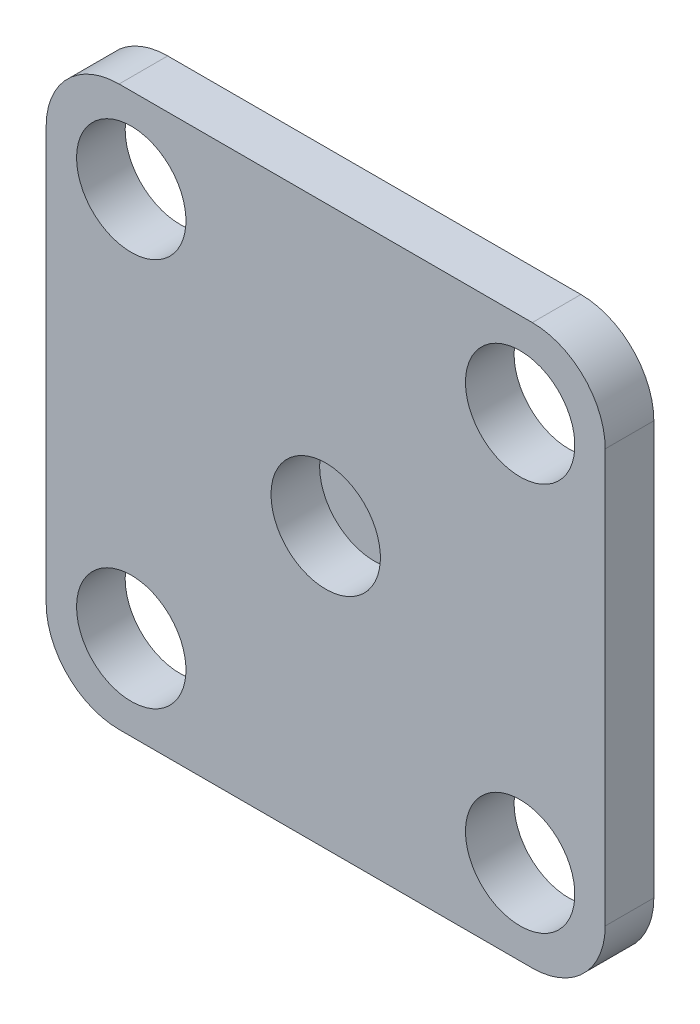
ISO-10303-21;
HEADER;
FILE_DESCRIPTION(('STEP AP214'),'2;1');
FILE_NAME('part.step','',(''),(''),'','','');
FILE_SCHEMA(('AUTOMOTIVE_DESIGN { 1 0 10303 214 1 1 1 1 }'));
ENDSEC;
DATA;
#1=APPLICATION_CONTEXT('core data for automotive mechanical design processes');
#2=APPLICATION_PROTOCOL_DEFINITION('international standard','automotive_design',2000,#1);
#3=PRODUCT_CONTEXT('',#1,'mechanical');
#4=PRODUCT('Part','Part','',(#3));
#5=PRODUCT_RELATED_PRODUCT_CATEGORY('part','',(#4));
#6=PRODUCT_DEFINITION_FORMATION('','',#4);
#7=PRODUCT_DEFINITION_CONTEXT('part definition',#1,'design');
#8=PRODUCT_DEFINITION('design','',#6,#7);
#9=PRODUCT_DEFINITION_SHAPE('','',#8);
#10=(LENGTH_UNIT() NAMED_UNIT(*) SI_UNIT(.MILLI.,.METRE.));
#11=(NAMED_UNIT(*) PLANE_ANGLE_UNIT() SI_UNIT($,.RADIAN.));
#12=(NAMED_UNIT(*) SI_UNIT($,.STERADIAN.) SOLID_ANGLE_UNIT());
#13=UNCERTAINTY_MEASURE_WITH_UNIT(LENGTH_MEASURE(1.E-05),#10,'distance_accuracy_value','');
#14=(GEOMETRIC_REPRESENTATION_CONTEXT(3) GLOBAL_UNCERTAINTY_ASSIGNED_CONTEXT((#13)) GLOBAL_UNIT_ASSIGNED_CONTEXT((#10,
#11,#12)) REPRESENTATION_CONTEXT('',''));
#15=CARTESIAN_POINT('',(0.,0.,0.));
#16=DIRECTION('',(0.,0.,1.));
#17=DIRECTION('',(1.,0.,0.));
#18=AXIS2_PLACEMENT_3D('',#15,#16,#17);
#19=CARTESIAN_POINT('',(0.,0.,2.));
#20=DIRECTION('',(1.,0.,0.));
#21=DIRECTION('',(0.,0.,-1.));
#22=AXIS2_PLACEMENT_3D('',#19,#20,#21);
#23=PLANE('',#22);
#24=DIRECTION('',(0.,-1.,0.));
#25=VECTOR('',#24,1.);
#26=CARTESIAN_POINT('',(0.,0.,2.));
#27=LINE('',#26,#25);
#28=CARTESIAN_POINT('',(0.,20.,2.));
#29=VERTEX_POINT('',#28);
#30=CARTESIAN_POINT('',(0.,3.,2.));
#31=VERTEX_POINT('',#30);
#32=EDGE_CURVE('E165',#29,#31,#27,.T.);
#33=ORIENTED_EDGE('',*,*,#32,.F.);
#34=DIRECTION('',(0.,0.,-1.));
#35=VECTOR('',#34,1.);
#36=CARTESIAN_POINT('',(0.,20.,2.));
#37=LINE('',#36,#35);
#38=CARTESIAN_POINT('',(0.,20.,0.));
#39=VERTEX_POINT('',#38);
#40=EDGE_CURVE('E184',#29,#39,#37,.T.);
#41=ORIENTED_EDGE('',*,*,#40,.T.);
#42=DIRECTION('',(0.,-1.,0.));
#43=VECTOR('',#42,1.);
#44=CARTESIAN_POINT('',(0.,0.,0.));
#45=LINE('',#44,#43);
#46=CARTESIAN_POINT('',(0.,3.,0.));
#47=VERTEX_POINT('',#46);
#48=EDGE_CURVE('E156',#39,#47,#45,.T.);
#49=ORIENTED_EDGE('',*,*,#48,.T.);
#50=DIRECTION('',(0.,0.,-1.));
#51=VECTOR('',#50,1.);
#52=CARTESIAN_POINT('',(0.,3.,2.));
#53=LINE('',#52,#51);
#54=EDGE_CURVE('E175',#47,#31,#53,.F.);
#55=ORIENTED_EDGE('',*,*,#54,.T.);
#56=EDGE_LOOP('',(#33,#41,#49,#55));
#57=FACE_BOUND('',#56,.T.);
#58=ADVANCED_FACE('F41',(#57),#23,.F.);
#59=CARTESIAN_POINT('',(0.,0.,2.));
#60=DIRECTION('',(0.,1.,0.));
#61=DIRECTION('',(0.,0.,1.));
#62=AXIS2_PLACEMENT_3D('',#59,#60,#61);
#63=PLANE('',#62);
#64=DIRECTION('',(1.,0.,0.));
#65=VECTOR('',#64,1.);
#66=CARTESIAN_POINT('',(0.,0.,2.));
#67=LINE('',#66,#65);
#68=CARTESIAN_POINT('',(3.,0.,2.));
#69=VERTEX_POINT('',#68);
#70=CARTESIAN_POINT('',(20.,0.,2.));
#71=VERTEX_POINT('',#70);
#72=EDGE_CURVE('E168',#69,#71,#67,.T.);
#73=ORIENTED_EDGE('',*,*,#72,.F.);
#74=DIRECTION('',(0.,0.,-1.));
#75=VECTOR('',#74,1.);
#76=CARTESIAN_POINT('',(3.,0.,2.));
#77=LINE('',#76,#75);
#78=CARTESIAN_POINT('',(3.,0.,0.));
#79=VERTEX_POINT('',#78);
#80=EDGE_CURVE('E209',#69,#79,#77,.T.);
#81=ORIENTED_EDGE('',*,*,#80,.T.);
#82=DIRECTION('',(1.,0.,0.));
#83=VECTOR('',#82,1.);
#84=CARTESIAN_POINT('',(0.,0.,0.));
#85=LINE('',#84,#83);
#86=CARTESIAN_POINT('',(20.,0.,0.));
#87=VERTEX_POINT('',#86);
#88=EDGE_CURVE('E159',#79,#87,#85,.T.);
#89=ORIENTED_EDGE('',*,*,#88,.T.);
#90=DIRECTION('',(0.,0.,-1.));
#91=VECTOR('',#90,1.);
#92=CARTESIAN_POINT('',(20.,0.,2.));
#93=LINE('',#92,#91);
#94=EDGE_CURVE('E207',#87,#71,#93,.F.);
#95=ORIENTED_EDGE('',*,*,#94,.T.);
#96=EDGE_LOOP('',(#73,#81,#89,#95));
#97=FACE_BOUND('',#96,.T.);
#98=ADVANCED_FACE('F215',(#97),#63,.F.);
#99=CARTESIAN_POINT('',(23.,0.,2.));
#100=DIRECTION('',(-1.,0.,0.));
#101=DIRECTION('',(0.,0.,1.));
#102=AXIS2_PLACEMENT_3D('',#99,#100,#101);
#103=PLANE('',#102);
#104=DIRECTION('',(0.,1.,0.));
#105=VECTOR('',#104,1.);
#106=CARTESIAN_POINT('',(23.,0.,2.));
#107=LINE('',#106,#105);
#108=CARTESIAN_POINT('',(23.,3.,2.));
#109=VERTEX_POINT('',#108);
#110=CARTESIAN_POINT('',(23.,20.,2.));
#111=VERTEX_POINT('',#110);
#112=EDGE_CURVE('E171',#109,#111,#107,.T.);
#113=ORIENTED_EDGE('',*,*,#112,.F.);
#114=DIRECTION('',(0.,0.,-1.));
#115=VECTOR('',#114,1.);
#116=CARTESIAN_POINT('',(23.,3.,2.));
#117=LINE('',#116,#115);
#118=CARTESIAN_POINT('',(23.,3.,0.));
#119=VERTEX_POINT('',#118);
#120=EDGE_CURVE('E11',#109,#119,#117,.T.);
#121=ORIENTED_EDGE('',*,*,#120,.T.);
#122=DIRECTION('',(0.,1.,0.));
#123=VECTOR('',#122,1.);
#124=CARTESIAN_POINT('',(23.,0.,0.));
#125=LINE('',#124,#123);
#126=CARTESIAN_POINT('',(23.,20.,0.));
#127=VERTEX_POINT('',#126);
#128=EDGE_CURVE('E179',#119,#127,#125,.T.);
#129=ORIENTED_EDGE('',*,*,#128,.T.);
#130=DIRECTION('',(0.,0.,-1.));
#131=VECTOR('',#130,1.);
#132=CARTESIAN_POINT('',(23.,20.,2.));
#133=LINE('',#132,#131);
#134=EDGE_CURVE('E49',#127,#111,#133,.F.);
#135=ORIENTED_EDGE('',*,*,#134,.T.);
#136=EDGE_LOOP('',(#113,#121,#129,#135));
#137=FACE_BOUND('',#136,.T.);
#138=ADVANCED_FACE('F226',(#137),#103,.F.);
#139=CARTESIAN_POINT('',(0.,23.,2.));
#140=DIRECTION('',(0.,-1.,0.));
#141=DIRECTION('',(0.,0.,-1.));
#142=AXIS2_PLACEMENT_3D('',#139,#140,#141);
#143=PLANE('',#142);
#144=DIRECTION('',(-1.,0.,0.));
#145=VECTOR('',#144,1.);
#146=CARTESIAN_POINT('',(0.,23.,0.));
#147=LINE('',#146,#145);
#148=CARTESIAN_POINT('',(20.,23.,0.));
#149=VERTEX_POINT('',#148);
#150=CARTESIAN_POINT('',(3.,23.,0.));
#151=VERTEX_POINT('',#150);
#152=EDGE_CURVE('E169',#149,#151,#147,.T.);
#153=ORIENTED_EDGE('',*,*,#152,.T.);
#154=DIRECTION('',(0.,0.,-1.));
#155=VECTOR('',#154,1.);
#156=CARTESIAN_POINT('',(3.,23.,2.));
#157=LINE('',#156,#155);
#158=CARTESIAN_POINT('',(3.,23.,2.));
#159=VERTEX_POINT('',#158);
#160=EDGE_CURVE('E198',#151,#159,#157,.F.);
#161=ORIENTED_EDGE('',*,*,#160,.T.);
#162=DIRECTION('',(-1.,0.,0.));
#163=VECTOR('',#162,1.);
#164=CARTESIAN_POINT('',(0.,23.,2.));
#165=LINE('',#164,#163);
#166=CARTESIAN_POINT('',(20.,23.,2.));
#167=VERTEX_POINT('',#166);
#168=EDGE_CURVE('E173',#167,#159,#165,.T.);
#169=ORIENTED_EDGE('',*,*,#168,.F.);
#170=DIRECTION('',(0.,0.,-1.));
#171=VECTOR('',#170,1.);
#172=CARTESIAN_POINT('',(20.,23.,2.));
#173=LINE('',#172,#171);
#174=EDGE_CURVE('E195',#167,#149,#173,.T.);
#175=ORIENTED_EDGE('',*,*,#174,.T.);
#176=EDGE_LOOP('',(#153,#161,#169,#175));
#177=FACE_BOUND('',#176,.T.);
#178=ADVANCED_FACE('F234',(#177),#143,.F.);
#179=CARTESIAN_POINT('',(0.,0.,2.));
#180=DIRECTION('',(0.,0.,-1.));
#181=DIRECTION('',(-1.,0.,0.));
#182=AXIS2_PLACEMENT_3D('',#179,#180,#181);
#183=PLANE('',#182);
#184=CARTESIAN_POINT('',(11.5,11.5,2.));
#185=DIRECTION('',(0.,0.,-1.));
#186=DIRECTION('',(-1.,0.,0.));
#187=AXIS2_PLACEMENT_3D('',#184,#185,#186);
#188=CIRCLE('',#187,2.25);
#189=CARTESIAN_POINT('',(9.25,11.5,2.));
#190=VERTEX_POINT('',#189);
#191=EDGE_CURVE('E310',#190,#190,#188,.T.);
#192=ORIENTED_EDGE('',*,*,#191,.T.);
#193=EDGE_LOOP('',(#192));
#194=FACE_BOUND('',#193,.T.);
#195=CARTESIAN_POINT('',(3.5,19.5,2.));
#196=DIRECTION('',(0.,0.,-1.));
#197=DIRECTION('',(-1.,0.,0.));
#198=AXIS2_PLACEMENT_3D('',#195,#196,#197);
#199=CIRCLE('',#198,2.25);
#200=CARTESIAN_POINT('',(1.25,19.5,2.));
#201=VERTEX_POINT('',#200);
#202=EDGE_CURVE('E320',#201,#201,#199,.T.);
#203=ORIENTED_EDGE('',*,*,#202,.T.);
#204=EDGE_LOOP('',(#203));
#205=FACE_BOUND('',#204,.T.);
#206=CARTESIAN_POINT('',(19.5,3.5,2.));
#207=DIRECTION('',(0.,0.,-1.));
#208=DIRECTION('',(-1.,0.,0.));
#209=AXIS2_PLACEMENT_3D('',#206,#207,#208);
#210=CIRCLE('',#209,2.25);
#211=CARTESIAN_POINT('',(17.25,3.5,2.));
#212=VERTEX_POINT('',#211);
#213=EDGE_CURVE('E326',#212,#212,#210,.T.);
#214=ORIENTED_EDGE('',*,*,#213,.T.);
#215=EDGE_LOOP('',(#214));
#216=FACE_BOUND('',#215,.T.);
#217=CARTESIAN_POINT('',(19.5,19.5,2.));
#218=DIRECTION('',(0.,0.,-1.));
#219=DIRECTION('',(-1.,0.,0.));
#220=AXIS2_PLACEMENT_3D('',#217,#218,#219);
#221=CIRCLE('',#220,2.25);
#222=CARTESIAN_POINT('',(17.25,19.5,2.));
#223=VERTEX_POINT('',#222);
#224=EDGE_CURVE('E332',#223,#223,#221,.T.);
#225=ORIENTED_EDGE('',*,*,#224,.T.);
#226=EDGE_LOOP('',(#225));
#227=FACE_BOUND('',#226,.T.);
#228=CARTESIAN_POINT('',(3.5,3.5,2.));
#229=DIRECTION('',(0.,0.,-1.));
#230=DIRECTION('',(-1.,0.,0.));
#231=AXIS2_PLACEMENT_3D('',#228,#229,#230);
#232=CIRCLE('',#231,2.25);
#233=CARTESIAN_POINT('',(1.25,3.5,2.));
#234=VERTEX_POINT('',#233);
#235=EDGE_CURVE('E338',#234,#234,#232,.T.);
#236=ORIENTED_EDGE('',*,*,#235,.T.);
#237=EDGE_LOOP('',(#236));
#238=FACE_BOUND('',#237,.T.);
#239=ORIENTED_EDGE('',*,*,#168,.T.);
#240=CARTESIAN_POINT('',(3.,20.,2.));
#241=DIRECTION('',(0.,0.,-1.));
#242=DIRECTION('',(-1.,0.,0.));
#243=AXIS2_PLACEMENT_3D('',#240,#241,#242);
#244=CIRCLE('',#243,3.);
#245=EDGE_CURVE('E205',#159,#29,#244,.F.);
#246=ORIENTED_EDGE('',*,*,#245,.T.);
#247=ORIENTED_EDGE('',*,*,#32,.T.);
#248=CARTESIAN_POINT('',(3.,3.,2.));
#249=DIRECTION('',(0.,0.,-1.));
#250=DIRECTION('',(-1.,0.,0.));
#251=AXIS2_PLACEMENT_3D('',#248,#249,#250);
#252=CIRCLE('',#251,3.);
#253=EDGE_CURVE('E203',#31,#69,#252,.F.);
#254=ORIENTED_EDGE('',*,*,#253,.T.);
#255=ORIENTED_EDGE('',*,*,#72,.T.);
#256=CARTESIAN_POINT('',(20.,3.,2.));
#257=DIRECTION('',(0.,0.,-1.));
#258=DIRECTION('',(-1.,0.,0.));
#259=AXIS2_PLACEMENT_3D('',#256,#257,#258);
#260=CIRCLE('',#259,3.);
#261=EDGE_CURVE('E62',#71,#109,#260,.F.);
#262=ORIENTED_EDGE('',*,*,#261,.T.);
#263=ORIENTED_EDGE('',*,*,#112,.T.);
#264=CARTESIAN_POINT('',(20.,20.,2.));
#265=DIRECTION('',(0.,0.,-1.));
#266=DIRECTION('',(-1.,0.,0.));
#267=AXIS2_PLACEMENT_3D('',#264,#265,#266);
#268=CIRCLE('',#267,3.);
#269=EDGE_CURVE('E200',#111,#167,#268,.F.);
#270=ORIENTED_EDGE('',*,*,#269,.T.);
#271=EDGE_LOOP('',(#239,#246,#247,#254,#255,#262,#263,#270));
#272=FACE_BOUND('',#271,.T.);
#273=ADVANCED_FACE('F228',(#194,#205,#216,#227,#238,#272),#183,.F.);
#274=CARTESIAN_POINT('',(0.,0.,0.));
#275=DIRECTION('',(0.,0.,-1.));
#276=DIRECTION('',(-1.,0.,0.));
#277=AXIS2_PLACEMENT_3D('',#274,#275,#276);
#278=PLANE('',#277);
#279=CARTESIAN_POINT('',(3.5,19.5,0.));
#280=DIRECTION('',(0.,0.,-1.));
#281=DIRECTION('',(-1.,0.,0.));
#282=AXIS2_PLACEMENT_3D('',#279,#280,#281);
#283=CIRCLE('',#282,2.24999999999999);
#284=CARTESIAN_POINT('',(1.25000000000001,19.5,0.));
#285=VERTEX_POINT('',#284);
#286=EDGE_CURVE('E315',#285,#285,#283,.T.);
#287=ORIENTED_EDGE('',*,*,#286,.F.);
#288=EDGE_LOOP('',(#287));
#289=FACE_BOUND('',#288,.T.);
#290=CARTESIAN_POINT('',(19.5,3.5,0.));
#291=DIRECTION('',(0.,0.,-1.));
#292=DIRECTION('',(-1.,0.,0.));
#293=AXIS2_PLACEMENT_3D('',#290,#291,#292);
#294=CIRCLE('',#293,2.24999999999999);
#295=CARTESIAN_POINT('',(17.25,3.5,0.));
#296=VERTEX_POINT('',#295);
#297=EDGE_CURVE('E323',#296,#296,#294,.T.);
#298=ORIENTED_EDGE('',*,*,#297,.F.);
#299=EDGE_LOOP('',(#298));
#300=FACE_BOUND('',#299,.T.);
#301=CARTESIAN_POINT('',(19.5,19.5,0.));
#302=DIRECTION('',(0.,0.,-1.));
#303=DIRECTION('',(-1.,0.,0.));
#304=AXIS2_PLACEMENT_3D('',#301,#302,#303);
#305=CIRCLE('',#304,2.24999999999999);
#306=CARTESIAN_POINT('',(17.25,19.5,0.));
#307=VERTEX_POINT('',#306);
#308=EDGE_CURVE('E329',#307,#307,#305,.T.);
#309=ORIENTED_EDGE('',*,*,#308,.F.);
#310=EDGE_LOOP('',(#309));
#311=FACE_BOUND('',#310,.T.);
#312=CARTESIAN_POINT('',(3.5,3.5,0.));
#313=DIRECTION('',(0.,0.,-1.));
#314=DIRECTION('',(-1.,0.,0.));
#315=AXIS2_PLACEMENT_3D('',#312,#313,#314);
#316=CIRCLE('',#315,2.24999999999999);
#317=CARTESIAN_POINT('',(1.25000000000001,3.5,0.));
#318=VERTEX_POINT('',#317);
#319=EDGE_CURVE('E335',#318,#318,#316,.T.);
#320=ORIENTED_EDGE('',*,*,#319,.F.);
#321=EDGE_LOOP('',(#320));
#322=FACE_BOUND('',#321,.T.);
#323=DIRECTION('',(-1.,0.,0.));
#324=VECTOR('',#323,1.);
#325=CARTESIAN_POINT('',(15.,8.,0.));
#326=LINE('',#325,#324);
#327=CARTESIAN_POINT('',(15.,8.,0.));
#328=VERTEX_POINT('',#327);
#329=CARTESIAN_POINT('',(8.,8.,0.));
#330=VERTEX_POINT('',#329);
#331=EDGE_CURVE('E155',#328,#330,#326,.T.);
#332=ORIENTED_EDGE('',*,*,#331,.F.);
#333=DIRECTION('',(0.,-1.,0.));
#334=VECTOR('',#333,1.);
#335=CARTESIAN_POINT('',(15.,15.,0.));
#336=LINE('',#335,#334);
#337=CARTESIAN_POINT('',(15.,15.,0.));
#338=VERTEX_POINT('',#337);
#339=EDGE_CURVE('E152',#338,#328,#336,.T.);
#340=ORIENTED_EDGE('',*,*,#339,.F.);
#341=DIRECTION('',(1.,0.,0.));
#342=VECTOR('',#341,1.);
#343=CARTESIAN_POINT('',(8.,15.,0.));
#344=LINE('',#343,#342);
#345=CARTESIAN_POINT('',(8.,15.,0.));
#346=VERTEX_POINT('',#345);
#347=EDGE_CURVE('E347',#346,#338,#344,.T.);
#348=ORIENTED_EDGE('',*,*,#347,.F.);
#349=DIRECTION('',(0.,1.,0.));
#350=VECTOR('',#349,1.);
#351=CARTESIAN_POINT('',(8.,8.,0.));
#352=LINE('',#351,#350);
#353=EDGE_CURVE('E345',#330,#346,#352,.T.);
#354=ORIENTED_EDGE('',*,*,#353,.F.);
#355=EDGE_LOOP('',(#332,#340,#348,#354));
#356=FACE_BOUND('',#355,.T.);
#357=ORIENTED_EDGE('',*,*,#48,.F.);
#358=CARTESIAN_POINT('',(3.,20.,0.));
#359=DIRECTION('',(0.,0.,-1.));
#360=DIRECTION('',(-1.,0.,0.));
#361=AXIS2_PLACEMENT_3D('',#358,#359,#360);
#362=CIRCLE('',#361,3.);
#363=EDGE_CURVE('E193',#39,#151,#362,.T.);
#364=ORIENTED_EDGE('',*,*,#363,.T.);
#365=ORIENTED_EDGE('',*,*,#152,.F.);
#366=CARTESIAN_POINT('',(20.,20.,0.));
#367=DIRECTION('',(0.,0.,-1.));
#368=DIRECTION('',(-1.,0.,0.));
#369=AXIS2_PLACEMENT_3D('',#366,#367,#368);
#370=CIRCLE('',#369,3.);
#371=EDGE_CURVE('E187',#149,#127,#370,.T.);
#372=ORIENTED_EDGE('',*,*,#371,.T.);
#373=ORIENTED_EDGE('',*,*,#128,.F.);
#374=CARTESIAN_POINT('',(20.,3.,0.));
#375=DIRECTION('',(0.,0.,-1.));
#376=DIRECTION('',(-1.,0.,0.));
#377=AXIS2_PLACEMENT_3D('',#374,#375,#376);
#378=CIRCLE('',#377,3.);
#379=EDGE_CURVE('E189',#119,#87,#378,.T.);
#380=ORIENTED_EDGE('',*,*,#379,.T.);
#381=ORIENTED_EDGE('',*,*,#88,.F.);
#382=CARTESIAN_POINT('',(3.,3.,0.));
#383=DIRECTION('',(0.,0.,-1.));
#384=DIRECTION('',(-1.,0.,0.));
#385=AXIS2_PLACEMENT_3D('',#382,#383,#384);
#386=CIRCLE('',#385,3.);
#387=EDGE_CURVE('E191',#79,#47,#386,.T.);
#388=ORIENTED_EDGE('',*,*,#387,.T.);
#389=EDGE_LOOP('',(#357,#364,#365,#372,#373,#380,#381,#388));
#390=FACE_BOUND('',#389,.T.);
#391=ADVANCED_FACE('F221',(#289,#300,#311,#322,#356,#390),#278,.T.);
#392=CARTESIAN_POINT('',(15.,8.,-1.5));
#393=DIRECTION('',(0.,1.,0.));
#394=DIRECTION('',(0.,0.,1.));
#395=AXIS2_PLACEMENT_3D('',#392,#393,#394);
#396=PLANE('',#395);
#397=ORIENTED_EDGE('',*,*,#331,.T.);
#398=DIRECTION('',(0.,0.,1.));
#399=VECTOR('',#398,1.);
#400=CARTESIAN_POINT('',(8.,8.,-1.5));
#401=LINE('',#400,#399);
#402=CARTESIAN_POINT('',(8.,8.,-1.5));
#403=VERTEX_POINT('',#402);
#404=EDGE_CURVE('E136',#403,#330,#401,.T.);
#405=ORIENTED_EDGE('',*,*,#404,.F.);
#406=DIRECTION('',(-1.,0.,0.));
#407=VECTOR('',#406,1.);
#408=CARTESIAN_POINT('',(15.,8.,-1.5));
#409=LINE('',#408,#407);
#410=CARTESIAN_POINT('',(15.,8.,-1.5));
#411=VERTEX_POINT('',#410);
#412=EDGE_CURVE('E143',#411,#403,#409,.T.);
#413=ORIENTED_EDGE('',*,*,#412,.F.);
#414=DIRECTION('',(0.,0.,1.));
#415=VECTOR('',#414,1.);
#416=CARTESIAN_POINT('',(15.,8.,-1.5));
#417=LINE('',#416,#415);
#418=EDGE_CURVE('E343',#411,#328,#417,.T.);
#419=ORIENTED_EDGE('',*,*,#418,.T.);
#420=EDGE_LOOP('',(#397,#405,#413,#419));
#421=FACE_BOUND('',#420,.T.);
#422=ADVANCED_FACE('F154',(#421),#396,.F.);
#423=CARTESIAN_POINT('',(8.,8.,-1.5));
#424=DIRECTION('',(1.,0.,0.));
#425=DIRECTION('',(0.,0.,-1.));
#426=AXIS2_PLACEMENT_3D('',#423,#424,#425);
#427=PLANE('',#426);
#428=ORIENTED_EDGE('',*,*,#353,.T.);
#429=DIRECTION('',(0.,0.,1.));
#430=VECTOR('',#429,1.);
#431=CARTESIAN_POINT('',(8.,15.,-1.5));
#432=LINE('',#431,#430);
#433=CARTESIAN_POINT('',(8.,15.,-1.5));
#434=VERTEX_POINT('',#433);
#435=EDGE_CURVE('E139',#434,#346,#432,.T.);
#436=ORIENTED_EDGE('',*,*,#435,.F.);
#437=DIRECTION('',(0.,1.,0.));
#438=VECTOR('',#437,1.);
#439=CARTESIAN_POINT('',(8.,8.,-1.5));
#440=LINE('',#439,#438);
#441=EDGE_CURVE('E131',#403,#434,#440,.T.);
#442=ORIENTED_EDGE('',*,*,#441,.F.);
#443=ORIENTED_EDGE('',*,*,#404,.T.);
#444=EDGE_LOOP('',(#428,#436,#442,#443));
#445=FACE_BOUND('',#444,.T.);
#446=ADVANCED_FACE('F134',(#445),#427,.F.);
#447=CARTESIAN_POINT('',(8.,15.,-1.5));
#448=DIRECTION('',(0.,-1.,0.));
#449=DIRECTION('',(0.,0.,-1.));
#450=AXIS2_PLACEMENT_3D('',#447,#448,#449);
#451=PLANE('',#450);
#452=ORIENTED_EDGE('',*,*,#347,.T.);
#453=DIRECTION('',(0.,0.,1.));
#454=VECTOR('',#453,1.);
#455=CARTESIAN_POINT('',(15.,15.,-1.5));
#456=LINE('',#455,#454);
#457=CARTESIAN_POINT('',(15.,15.,-1.5));
#458=VERTEX_POINT('',#457);
#459=EDGE_CURVE('E161',#458,#338,#456,.T.);
#460=ORIENTED_EDGE('',*,*,#459,.F.);
#461=DIRECTION('',(1.,0.,0.));
#462=VECTOR('',#461,1.);
#463=CARTESIAN_POINT('',(8.,15.,-1.5));
#464=LINE('',#463,#462);
#465=EDGE_CURVE('E142',#434,#458,#464,.T.);
#466=ORIENTED_EDGE('',*,*,#465,.F.);
#467=ORIENTED_EDGE('',*,*,#435,.T.);
#468=EDGE_LOOP('',(#452,#460,#466,#467));
#469=FACE_BOUND('',#468,.T.);
#470=ADVANCED_FACE('F273',(#469),#451,.F.);
#471=CARTESIAN_POINT('',(15.,15.,-1.5));
#472=DIRECTION('',(-1.,0.,0.));
#473=DIRECTION('',(0.,0.,1.));
#474=AXIS2_PLACEMENT_3D('',#471,#472,#473);
#475=PLANE('',#474);
#476=ORIENTED_EDGE('',*,*,#339,.T.);
#477=ORIENTED_EDGE('',*,*,#418,.F.);
#478=DIRECTION('',(0.,-1.,0.));
#479=VECTOR('',#478,1.);
#480=CARTESIAN_POINT('',(15.,15.,-1.5));
#481=LINE('',#480,#479);
#482=EDGE_CURVE('E148',#458,#411,#481,.T.);
#483=ORIENTED_EDGE('',*,*,#482,.F.);
#484=ORIENTED_EDGE('',*,*,#459,.T.);
#485=EDGE_LOOP('',(#476,#477,#483,#484));
#486=FACE_BOUND('',#485,.T.);
#487=ADVANCED_FACE('F276',(#486),#475,.F.);
#488=CARTESIAN_POINT('',(0.,0.,-1.5));
#489=DIRECTION('',(0.,0.,-1.));
#490=DIRECTION('',(-1.,0.,0.));
#491=AXIS2_PLACEMENT_3D('',#488,#489,#490);
#492=PLANE('',#491);
#493=ORIENTED_EDGE('',*,*,#412,.T.);
#494=ORIENTED_EDGE('',*,*,#441,.T.);
#495=ORIENTED_EDGE('',*,*,#465,.T.);
#496=ORIENTED_EDGE('',*,*,#482,.T.);
#497=EDGE_LOOP('',(#493,#494,#495,#496));
#498=FACE_BOUND('',#497,.T.);
#499=ADVANCED_FACE('F146',(#498),#492,.T.);
#500=CARTESIAN_POINT('',(3.,20.,2.));
#501=DIRECTION('',(0.,0.,-1.));
#502=DIRECTION('',(-1.,0.,0.));
#503=AXIS2_PLACEMENT_3D('',#500,#501,#502);
#504=CYLINDRICAL_SURFACE('',#503,3.);
#505=ORIENTED_EDGE('',*,*,#245,.F.);
#506=ORIENTED_EDGE('',*,*,#160,.F.);
#507=ORIENTED_EDGE('',*,*,#363,.F.);
#508=ORIENTED_EDGE('',*,*,#40,.F.);
#509=EDGE_LOOP('',(#505,#506,#507,#508));
#510=FACE_BOUND('',#509,.T.);
#511=ADVANCED_FACE('F239',(#510),#504,.T.);
#512=CARTESIAN_POINT('',(3.,3.,2.));
#513=DIRECTION('',(0.,0.,-1.));
#514=DIRECTION('',(-1.,0.,0.));
#515=AXIS2_PLACEMENT_3D('',#512,#513,#514);
#516=CYLINDRICAL_SURFACE('',#515,3.);
#517=ORIENTED_EDGE('',*,*,#253,.F.);
#518=ORIENTED_EDGE('',*,*,#54,.F.);
#519=ORIENTED_EDGE('',*,*,#387,.F.);
#520=ORIENTED_EDGE('',*,*,#80,.F.);
#521=EDGE_LOOP('',(#517,#518,#519,#520));
#522=FACE_BOUND('',#521,.T.);
#523=ADVANCED_FACE('F243',(#522),#516,.T.);
#524=CARTESIAN_POINT('',(20.,3.,2.));
#525=DIRECTION('',(0.,0.,-1.));
#526=DIRECTION('',(-1.,0.,0.));
#527=AXIS2_PLACEMENT_3D('',#524,#525,#526);
#528=CYLINDRICAL_SURFACE('',#527,3.);
#529=ORIENTED_EDGE('',*,*,#261,.F.);
#530=ORIENTED_EDGE('',*,*,#94,.F.);
#531=ORIENTED_EDGE('',*,*,#379,.F.);
#532=ORIENTED_EDGE('',*,*,#120,.F.);
#533=EDGE_LOOP('',(#529,#530,#531,#532));
#534=FACE_BOUND('',#533,.T.);
#535=ADVANCED_FACE('F225',(#534),#528,.T.);
#536=CARTESIAN_POINT('',(20.,20.,2.));
#537=DIRECTION('',(0.,0.,-1.));
#538=DIRECTION('',(-1.,0.,0.));
#539=AXIS2_PLACEMENT_3D('',#536,#537,#538);
#540=CYLINDRICAL_SURFACE('',#539,3.);
#541=ORIENTED_EDGE('',*,*,#269,.F.);
#542=ORIENTED_EDGE('',*,*,#134,.F.);
#543=ORIENTED_EDGE('',*,*,#371,.F.);
#544=ORIENTED_EDGE('',*,*,#174,.F.);
#545=EDGE_LOOP('',(#541,#542,#543,#544));
#546=FACE_BOUND('',#545,.T.);
#547=ADVANCED_FACE('F43',(#546),#540,.T.);
#548=CARTESIAN_POINT('',(3.5,3.5,0.));
#549=DIRECTION('',(0.,0.,-1.));
#550=DIRECTION('',(-1.,0.,0.));
#551=AXIS2_PLACEMENT_3D('',#548,#549,#550);
#552=CYLINDRICAL_SURFACE('',#551,2.24999999999999);
#553=ORIENTED_EDGE('',*,*,#235,.F.);
#554=EDGE_LOOP('',(#553));
#555=FACE_BOUND('',#554,.T.);
#556=ORIENTED_EDGE('',*,*,#319,.T.);
#557=EDGE_LOOP('',(#556));
#558=FACE_BOUND('',#557,.T.);
#559=ADVANCED_FACE('F282',(#555,#558),#552,.F.);
#560=CARTESIAN_POINT('',(19.5,19.5,0.));
#561=DIRECTION('',(0.,0.,-1.));
#562=DIRECTION('',(-1.,0.,0.));
#563=AXIS2_PLACEMENT_3D('',#560,#561,#562);
#564=CYLINDRICAL_SURFACE('',#563,2.24999999999999);
#565=ORIENTED_EDGE('',*,*,#224,.F.);
#566=EDGE_LOOP('',(#565));
#567=FACE_BOUND('',#566,.T.);
#568=ORIENTED_EDGE('',*,*,#308,.T.);
#569=EDGE_LOOP('',(#568));
#570=FACE_BOUND('',#569,.T.);
#571=ADVANCED_FACE('F285',(#567,#570),#564,.F.);
#572=CARTESIAN_POINT('',(19.5,3.5,0.));
#573=DIRECTION('',(0.,0.,-1.));
#574=DIRECTION('',(-1.,0.,0.));
#575=AXIS2_PLACEMENT_3D('',#572,#573,#574);
#576=CYLINDRICAL_SURFACE('',#575,2.24999999999999);
#577=ORIENTED_EDGE('',*,*,#213,.F.);
#578=EDGE_LOOP('',(#577));
#579=FACE_BOUND('',#578,.T.);
#580=ORIENTED_EDGE('',*,*,#297,.T.);
#581=EDGE_LOOP('',(#580));
#582=FACE_BOUND('',#581,.T.);
#583=ADVANCED_FACE('F289',(#579,#582),#576,.F.);
#584=CARTESIAN_POINT('',(3.5,19.5,0.));
#585=DIRECTION('',(0.,0.,-1.));
#586=DIRECTION('',(-1.,0.,0.));
#587=AXIS2_PLACEMENT_3D('',#584,#585,#586);
#588=CYLINDRICAL_SURFACE('',#587,2.24999999999999);
#589=ORIENTED_EDGE('',*,*,#202,.F.);
#590=EDGE_LOOP('',(#589));
#591=FACE_BOUND('',#590,.T.);
#592=ORIENTED_EDGE('',*,*,#286,.T.);
#593=EDGE_LOOP('',(#592));
#594=FACE_BOUND('',#593,.T.);
#595=ADVANCED_FACE('F293',(#591,#594),#588,.F.);
#596=CARTESIAN_POINT('',(13.75,11.5,0.));
#597=DIRECTION('',(0.,0.,-1.));
#598=DIRECTION('',(-1.,0.,0.));
#599=AXIS2_PLACEMENT_3D('',#596,#597,#598);
#600=PLANE('',#599);
#601=CARTESIAN_POINT('',(11.5,11.5,0.));
#602=DIRECTION('',(0.,0.,-1.));
#603=DIRECTION('',(-1.,0.,0.));
#604=AXIS2_PLACEMENT_3D('',#601,#602,#603);
#605=CIRCLE('',#604,2.24999999999999);
#606=CARTESIAN_POINT('',(9.25000000000001,11.5,0.));
#607=VERTEX_POINT('',#606);
#608=EDGE_CURVE('E313',#607,#607,#605,.T.);
#609=ORIENTED_EDGE('',*,*,#608,.F.);
#610=EDGE_LOOP('',(#609));
#611=FACE_BOUND('',#610,.T.);
#612=ADVANCED_FACE('F297',(#611),#600,.F.);
#613=CARTESIAN_POINT('',(11.5,11.5,0.));
#614=DIRECTION('',(0.,0.,-1.));
#615=DIRECTION('',(-1.,0.,0.));
#616=AXIS2_PLACEMENT_3D('',#613,#614,#615);
#617=CYLINDRICAL_SURFACE('',#616,2.24999999999999);
#618=ORIENTED_EDGE('',*,*,#191,.F.);
#619=EDGE_LOOP('',(#618));
#620=FACE_BOUND('',#619,.T.);
#621=ORIENTED_EDGE('',*,*,#608,.T.);
#622=EDGE_LOOP('',(#621));
#623=FACE_BOUND('',#622,.T.);
#624=ADVANCED_FACE('F301',(#620,#623),#617,.F.);
#625=CLOSED_SHELL('',(#58,#98,#138,#178,#273,#391,#422,#446,#470,#487,#499,#511,#523,#535,#547,
#559,#571,#583,#595,#612,#624));
#626=MANIFOLD_SOLID_BREP('B2',#625);
#627=ADVANCED_BREP_SHAPE_REPRESENTATION('',(#18,#626),#14);
#628=SHAPE_DEFINITION_REPRESENTATION(#9,#627);
ENDSEC;
END-ISO-10303-21;
